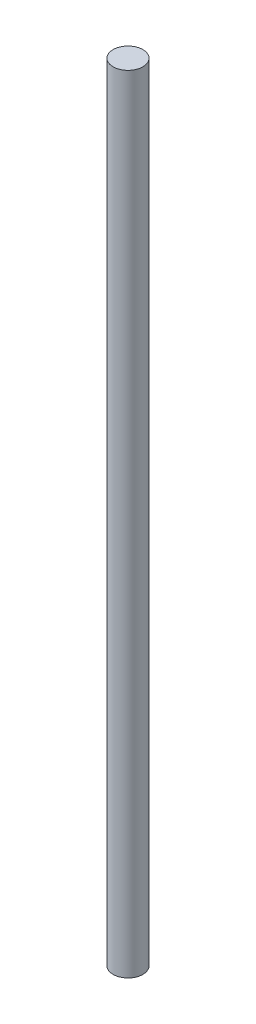
ISO-10303-21;
HEADER;
FILE_DESCRIPTION(('STEP AP214'),'2;1');
FILE_NAME('part.step','',(''),(''),'','','');
FILE_SCHEMA(('AUTOMOTIVE_DESIGN { 1 0 10303 214 1 1 1 1 }'));
ENDSEC;
DATA;
#1=APPLICATION_CONTEXT('core data for automotive mechanical design processes');
#2=APPLICATION_PROTOCOL_DEFINITION('international standard','automotive_design',2000,#1);
#3=PRODUCT_CONTEXT('',#1,'mechanical');
#4=PRODUCT('Part','Part','',(#3));
#5=PRODUCT_RELATED_PRODUCT_CATEGORY('part','',(#4));
#6=PRODUCT_DEFINITION_FORMATION('','',#4);
#7=PRODUCT_DEFINITION_CONTEXT('part definition',#1,'design');
#8=PRODUCT_DEFINITION('design','',#6,#7);
#9=PRODUCT_DEFINITION_SHAPE('','',#8);
#10=(LENGTH_UNIT() NAMED_UNIT(*) SI_UNIT(.MILLI.,.METRE.));
#11=(NAMED_UNIT(*) PLANE_ANGLE_UNIT() SI_UNIT($,.RADIAN.));
#12=(NAMED_UNIT(*) SI_UNIT($,.STERADIAN.) SOLID_ANGLE_UNIT());
#13=UNCERTAINTY_MEASURE_WITH_UNIT(LENGTH_MEASURE(1.E-05),#10,'distance_accuracy_value','');
#14=(GEOMETRIC_REPRESENTATION_CONTEXT(3) GLOBAL_UNCERTAINTY_ASSIGNED_CONTEXT((#13)) GLOBAL_UNIT_ASSIGNED_CONTEXT((#10,
#11,#12)) REPRESENTATION_CONTEXT('',''));
#15=CARTESIAN_POINT('',(0.,0.,0.));
#16=DIRECTION('',(0.,0.,1.));
#17=DIRECTION('',(1.,0.,0.));
#18=AXIS2_PLACEMENT_3D('',#15,#16,#17);
#19=CARTESIAN_POINT('',(0.,290.,0.));
#20=DIRECTION('',(0.,-1.,0.));
#21=DIRECTION('',(0.,0.,-1.));
#22=AXIS2_PLACEMENT_3D('',#19,#20,#21);
#23=CYLINDRICAL_SURFACE('',#22,5.5);
#24=CARTESIAN_POINT('',(0.,290.,0.));
#25=DIRECTION('',(0.,1.,0.));
#26=DIRECTION('',(0.,0.,1.));
#27=AXIS2_PLACEMENT_3D('',#24,#25,#26);
#28=CIRCLE('',#27,5.5);
#29=CARTESIAN_POINT('',(0.,290.,5.5));
#30=VERTEX_POINT('',#29);
#31=EDGE_CURVE('E10',#30,#30,#28,.T.);
#32=ORIENTED_EDGE('',*,*,#31,.F.);
#33=EDGE_LOOP('',(#32));
#34=FACE_BOUND('',#33,.T.);
#35=CARTESIAN_POINT('',(0.,0.,0.));
#36=DIRECTION('',(0.,1.,0.));
#37=DIRECTION('',(0.,0.,1.));
#38=AXIS2_PLACEMENT_3D('',#35,#36,#37);
#39=CIRCLE('',#38,5.5);
#40=CARTESIAN_POINT('',(0.,0.,5.5));
#41=VERTEX_POINT('',#40);
#42=EDGE_CURVE('E38',#41,#41,#39,.T.);
#43=ORIENTED_EDGE('',*,*,#42,.T.);
#44=EDGE_LOOP('',(#43));
#45=FACE_BOUND('',#44,.T.);
#46=ADVANCED_FACE('F35',(#34,#45),#23,.T.);
#47=CARTESIAN_POINT('',(0.,290.,0.));
#48=DIRECTION('',(0.,1.,0.));
#49=DIRECTION('',(0.,0.,1.));
#50=AXIS2_PLACEMENT_3D('',#47,#48,#49);
#51=PLANE('',#50);
#52=ORIENTED_EDGE('',*,*,#31,.T.);
#53=EDGE_LOOP('',(#52));
#54=FACE_BOUND('',#53,.T.);
#55=ADVANCED_FACE('F50',(#54),#51,.T.);
#56=CARTESIAN_POINT('',(0.,0.,0.));
#57=DIRECTION('',(0.,1.,0.));
#58=DIRECTION('',(0.,0.,1.));
#59=AXIS2_PLACEMENT_3D('',#56,#57,#58);
#60=PLANE('',#59);
#61=ORIENTED_EDGE('',*,*,#42,.F.);
#62=EDGE_LOOP('',(#61));
#63=FACE_BOUND('',#62,.T.);
#64=ADVANCED_FACE('F48',(#63),#60,.F.);
#65=CLOSED_SHELL('',(#46,#55,#64));
#66=MANIFOLD_SOLID_BREP('B2',#65);
#67=ADVANCED_BREP_SHAPE_REPRESENTATION('',(#18,#66),#14);
#68=SHAPE_DEFINITION_REPRESENTATION(#9,#67);
ENDSEC;
END-ISO-10303-21;
